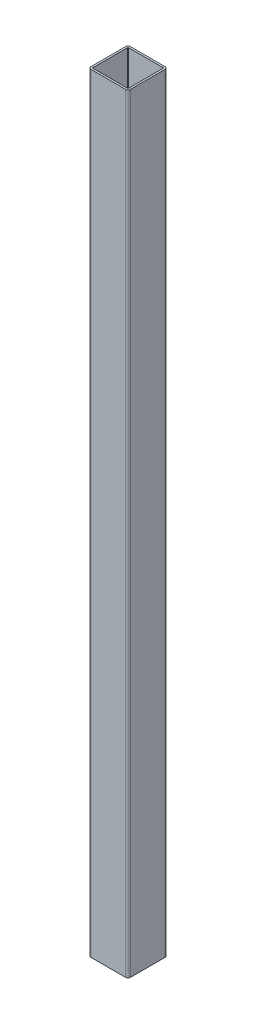
ISO-10303-21;
HEADER;
FILE_DESCRIPTION(('STEP AP214'),'2;1');
FILE_NAME('part.step','',(''),(''),'','','');
FILE_SCHEMA(('AUTOMOTIVE_DESIGN { 1 0 10303 214 1 1 1 1 }'));
ENDSEC;
DATA;
#1=APPLICATION_CONTEXT('core data for automotive mechanical design processes');
#2=APPLICATION_PROTOCOL_DEFINITION('international standard','automotive_design',2000,#1);
#3=PRODUCT_CONTEXT('',#1,'mechanical');
#4=PRODUCT('Part','Part','',(#3));
#5=PRODUCT_RELATED_PRODUCT_CATEGORY('part','',(#4));
#6=PRODUCT_DEFINITION_FORMATION('','',#4);
#7=PRODUCT_DEFINITION_CONTEXT('part definition',#1,'design');
#8=PRODUCT_DEFINITION('design','',#6,#7);
#9=PRODUCT_DEFINITION_SHAPE('','',#8);
#10=(LENGTH_UNIT() NAMED_UNIT(*) SI_UNIT(.MILLI.,.METRE.));
#11=(NAMED_UNIT(*) PLANE_ANGLE_UNIT() SI_UNIT($,.RADIAN.));
#12=(NAMED_UNIT(*) SI_UNIT($,.STERADIAN.) SOLID_ANGLE_UNIT());
#13=UNCERTAINTY_MEASURE_WITH_UNIT(LENGTH_MEASURE(1.E-05),#10,'distance_accuracy_value','');
#14=(GEOMETRIC_REPRESENTATION_CONTEXT(3) GLOBAL_UNCERTAINTY_ASSIGNED_CONTEXT((#13)) GLOBAL_UNIT_ASSIGNED_CONTEXT((#10,
#11,#12)) REPRESENTATION_CONTEXT('',''));
#15=CARTESIAN_POINT('',(0.,0.,0.));
#16=DIRECTION('',(0.,0.,1.));
#17=DIRECTION('',(1.,0.,0.));
#18=AXIS2_PLACEMENT_3D('',#15,#16,#17);
#19=CARTESIAN_POINT('',(126.666666666667,2762.5,-126.666666666667));
#20=DIRECTION('',(0.,-1.,0.));
#21=DIRECTION('',(0.,0.,-1.));
#22=AXIS2_PLACEMENT_3D('',#19,#20,#21);
#23=PLANE('',#22);
#24=CARTESIAN_POINT('',(126.666666666667,2762.5,-126.666666666667));
#25=DIRECTION('',(0.,1.,0.));
#26=DIRECTION('',(0.,0.,-1.));
#27=AXIS2_PLACEMENT_3D('',#24,#25,#26);
#28=CIRCLE('',#27,15.);
#29=CARTESIAN_POINT('',(141.666666666667,2762.5,-126.666666666667));
#30=VERTEX_POINT('',#29);
#31=CARTESIAN_POINT('',(126.666666666667,2762.5,-141.666666666667));
#32=VERTEX_POINT('',#31);
#33=EDGE_CURVE('E217',#30,#32,#28,.T.);
#34=ORIENTED_EDGE('',*,*,#33,.T.);
#35=DIRECTION('',(-1.,0.,0.));
#36=VECTOR('',#35,1.);
#37=CARTESIAN_POINT('',(-93.3333333333332,2762.5,-141.666666666667));
#38=LINE('',#37,#36);
#39=CARTESIAN_POINT('',(-93.3333333333332,2762.5,-141.666666666667));
#40=VERTEX_POINT('',#39);
#41=EDGE_CURVE('E220',#32,#40,#38,.T.);
#42=ORIENTED_EDGE('',*,*,#41,.T.);
#43=CARTESIAN_POINT('',(-93.3333333333332,2762.5,-126.666666666667));
#44=DIRECTION('',(0.,1.,0.));
#45=DIRECTION('',(0.,0.,-1.));
#46=AXIS2_PLACEMENT_3D('',#43,#44,#45);
#47=CIRCLE('',#46,15.);
#48=CARTESIAN_POINT('',(-108.333333333333,2762.5,-126.666666666667));
#49=VERTEX_POINT('',#48);
#50=EDGE_CURVE('E223',#40,#49,#47,.T.);
#51=ORIENTED_EDGE('',*,*,#50,.T.);
#52=DIRECTION('',(0.,0.,1.));
#53=VECTOR('',#52,1.);
#54=CARTESIAN_POINT('',(-108.333333333333,2762.5,93.3333333333332));
#55=LINE('',#54,#53);
#56=CARTESIAN_POINT('',(-108.333333333333,2762.5,93.3333333333332));
#57=VERTEX_POINT('',#56);
#58=EDGE_CURVE('E225',#49,#57,#55,.T.);
#59=ORIENTED_EDGE('',*,*,#58,.T.);
#60=CARTESIAN_POINT('',(-93.3333333333332,2762.5,93.3333333333333));
#61=DIRECTION('',(0.,1.,0.));
#62=DIRECTION('',(0.,0.,-1.));
#63=AXIS2_PLACEMENT_3D('',#60,#61,#62);
#64=CIRCLE('',#63,15.);
#65=CARTESIAN_POINT('',(-93.3333333333331,2762.5,108.333333333333));
#66=VERTEX_POINT('',#65);
#67=EDGE_CURVE('E227',#57,#66,#64,.T.);
#68=ORIENTED_EDGE('',*,*,#67,.T.);
#69=DIRECTION('',(1.,0.,0.));
#70=VECTOR('',#69,1.);
#71=CARTESIAN_POINT('',(-93.3333333333331,2762.5,108.333333333333));
#72=LINE('',#71,#70);
#73=CARTESIAN_POINT('',(126.666666666667,2762.5,108.333333333333));
#74=VERTEX_POINT('',#73);
#75=EDGE_CURVE('E229',#66,#74,#72,.T.);
#76=ORIENTED_EDGE('',*,*,#75,.T.);
#77=CARTESIAN_POINT('',(126.666666666667,2762.5,93.3333333333333));
#78=DIRECTION('',(0.,1.,0.));
#79=DIRECTION('',(0.,0.,1.));
#80=AXIS2_PLACEMENT_3D('',#77,#78,#79);
#81=CIRCLE('',#80,15.);
#82=CARTESIAN_POINT('',(141.666666666667,2762.5,93.3333333333333));
#83=VERTEX_POINT('',#82);
#84=EDGE_CURVE('E231',#74,#83,#81,.T.);
#85=ORIENTED_EDGE('',*,*,#84,.T.);
#86=DIRECTION('',(0.,0.,-1.));
#87=VECTOR('',#86,1.);
#88=CARTESIAN_POINT('',(141.666666666667,2762.5,93.3333333333333));
#89=LINE('',#88,#87);
#90=EDGE_CURVE('E233',#83,#30,#89,.T.);
#91=ORIENTED_EDGE('',*,*,#90,.T.);
#92=EDGE_LOOP('',(#34,#42,#51,#59,#68,#76,#85,#91));
#93=FACE_BOUND('',#92,.T.);
#94=CARTESIAN_POINT('',(-93.3333333333332,2762.5,93.3333333333333));
#95=DIRECTION('',(0.,1.,0.));
#96=DIRECTION('',(0.,0.,-1.));
#97=AXIS2_PLACEMENT_3D('',#94,#95,#96);
#98=CIRCLE('',#97,3.);
#99=CARTESIAN_POINT('',(-96.3333333333332,2762.5,93.3333333333332));
#100=VERTEX_POINT('',#99);
#101=CARTESIAN_POINT('',(-93.3333333333331,2762.5,96.3333333333333));
#102=VERTEX_POINT('',#101);
#103=EDGE_CURVE('E152',#100,#102,#98,.T.);
#104=ORIENTED_EDGE('',*,*,#103,.F.);
#105=DIRECTION('',(0.,0.,1.));
#106=VECTOR('',#105,1.);
#107=CARTESIAN_POINT('',(-96.3333333333332,2762.5,93.3333333333332));
#108=LINE('',#107,#106);
#109=CARTESIAN_POINT('',(-96.3333333333332,2762.5,-126.666666666667));
#110=VERTEX_POINT('',#109);
#111=EDGE_CURVE('E185',#110,#100,#108,.T.);
#112=ORIENTED_EDGE('',*,*,#111,.F.);
#113=CARTESIAN_POINT('',(-93.3333333333332,2762.5,-126.666666666667));
#114=DIRECTION('',(0.,1.,0.));
#115=DIRECTION('',(0.,0.,-1.));
#116=AXIS2_PLACEMENT_3D('',#113,#114,#115);
#117=CIRCLE('',#116,2.99999999999999);
#118=CARTESIAN_POINT('',(-93.3333333333332,2762.5,-129.666666666667));
#119=VERTEX_POINT('',#118);
#120=EDGE_CURVE('E183',#119,#110,#117,.T.);
#121=ORIENTED_EDGE('',*,*,#120,.F.);
#122=DIRECTION('',(-1.,0.,0.));
#123=VECTOR('',#122,1.);
#124=CARTESIAN_POINT('',(-93.3333333333332,2762.5,-129.666666666667));
#125=LINE('',#124,#123);
#126=CARTESIAN_POINT('',(126.666666666667,2762.5,-129.666666666667));
#127=VERTEX_POINT('',#126);
#128=EDGE_CURVE('E181',#127,#119,#125,.T.);
#129=ORIENTED_EDGE('',*,*,#128,.F.);
#130=CARTESIAN_POINT('',(126.666666666667,2762.5,-126.666666666667));
#131=DIRECTION('',(0.,1.,0.));
#132=DIRECTION('',(0.,0.,-1.));
#133=AXIS2_PLACEMENT_3D('',#130,#131,#132);
#134=CIRCLE('',#133,3.00000000000003);
#135=CARTESIAN_POINT('',(129.666666666667,2762.5,-126.666666666667));
#136=VERTEX_POINT('',#135);
#137=EDGE_CURVE('E179',#136,#127,#134,.T.);
#138=ORIENTED_EDGE('',*,*,#137,.F.);
#139=DIRECTION('',(0.,0.,-1.));
#140=VECTOR('',#139,1.);
#141=CARTESIAN_POINT('',(129.666666666667,2762.5,93.3333333333333));
#142=LINE('',#141,#140);
#143=CARTESIAN_POINT('',(129.666666666667,2762.5,93.3333333333333));
#144=VERTEX_POINT('',#143);
#145=EDGE_CURVE('E175',#144,#136,#142,.T.);
#146=ORIENTED_EDGE('',*,*,#145,.F.);
#147=CARTESIAN_POINT('',(126.666666666667,2762.5,93.3333333333333));
#148=DIRECTION('',(0.,1.,0.));
#149=DIRECTION('',(0.,0.,1.));
#150=AXIS2_PLACEMENT_3D('',#147,#148,#149);
#151=CIRCLE('',#150,3.00000000000002);
#152=CARTESIAN_POINT('',(126.666666666667,2762.5,96.3333333333334));
#153=VERTEX_POINT('',#152);
#154=EDGE_CURVE('E173',#153,#144,#151,.T.);
#155=ORIENTED_EDGE('',*,*,#154,.F.);
#156=DIRECTION('',(1.,0.,0.));
#157=VECTOR('',#156,1.);
#158=CARTESIAN_POINT('',(-93.3333333333331,2762.5,96.3333333333333));
#159=LINE('',#158,#157);
#160=EDGE_CURVE('E160',#102,#153,#159,.T.);
#161=ORIENTED_EDGE('',*,*,#160,.F.);
#162=EDGE_LOOP('',(#104,#112,#121,#129,#138,#146,#155,#161));
#163=FACE_BOUND('',#162,.T.);
#164=ADVANCED_FACE('F39',(#93,#163),#23,.F.);
#165=CARTESIAN_POINT('',(126.666666666667,-2112.5,-126.666666666667));
#166=DIRECTION('',(0.,-1.,0.));
#167=DIRECTION('',(0.,0.,-1.));
#168=AXIS2_PLACEMENT_3D('',#165,#166,#167);
#169=PLANE('',#168);
#170=CARTESIAN_POINT('',(126.666666666667,-2112.5,-126.666666666667));
#171=DIRECTION('',(0.,1.,0.));
#172=DIRECTION('',(0.,0.,-1.));
#173=AXIS2_PLACEMENT_3D('',#170,#171,#172);
#174=CIRCLE('',#173,15.);
#175=CARTESIAN_POINT('',(141.666666666667,-2112.5,-126.666666666667));
#176=VERTEX_POINT('',#175);
#177=CARTESIAN_POINT('',(126.666666666667,-2112.5,-141.666666666667));
#178=VERTEX_POINT('',#177);
#179=EDGE_CURVE('E168',#176,#178,#174,.T.);
#180=ORIENTED_EDGE('',*,*,#179,.F.);
#181=DIRECTION('',(0.,0.,-1.));
#182=VECTOR('',#181,1.);
#183=CARTESIAN_POINT('',(141.666666666667,-2112.5,93.3333333333333));
#184=LINE('',#183,#182);
#185=CARTESIAN_POINT('',(141.666666666667,-2112.5,93.3333333333333));
#186=VERTEX_POINT('',#185);
#187=EDGE_CURVE('E221',#186,#176,#184,.T.);
#188=ORIENTED_EDGE('',*,*,#187,.F.);
#189=CARTESIAN_POINT('',(126.666666666667,-2112.5,93.3333333333333));
#190=DIRECTION('',(0.,1.,0.));
#191=DIRECTION('',(0.,0.,1.));
#192=AXIS2_PLACEMENT_3D('',#189,#190,#191);
#193=CIRCLE('',#192,15.);
#194=CARTESIAN_POINT('',(126.666666666667,-2112.5,108.333333333333));
#195=VERTEX_POINT('',#194);
#196=EDGE_CURVE('E248',#195,#186,#193,.T.);
#197=ORIENTED_EDGE('',*,*,#196,.F.);
#198=DIRECTION('',(1.,0.,0.));
#199=VECTOR('',#198,1.);
#200=CARTESIAN_POINT('',(-93.3333333333331,-2112.5,108.333333333333));
#201=LINE('',#200,#199);
#202=CARTESIAN_POINT('',(-93.3333333333331,-2112.5,108.333333333333));
#203=VERTEX_POINT('',#202);
#204=EDGE_CURVE('E246',#203,#195,#201,.T.);
#205=ORIENTED_EDGE('',*,*,#204,.F.);
#206=CARTESIAN_POINT('',(-93.3333333333332,-2112.5,93.3333333333333));
#207=DIRECTION('',(0.,1.,0.));
#208=DIRECTION('',(0.,0.,-1.));
#209=AXIS2_PLACEMENT_3D('',#206,#207,#208);
#210=CIRCLE('',#209,15.);
#211=CARTESIAN_POINT('',(-108.333333333333,-2112.5,93.3333333333332));
#212=VERTEX_POINT('',#211);
#213=EDGE_CURVE('E244',#212,#203,#210,.T.);
#214=ORIENTED_EDGE('',*,*,#213,.F.);
#215=DIRECTION('',(0.,0.,1.));
#216=VECTOR('',#215,1.);
#217=CARTESIAN_POINT('',(-108.333333333333,-2112.5,93.3333333333332));
#218=LINE('',#217,#216);
#219=CARTESIAN_POINT('',(-108.333333333333,-2112.5,-126.666666666667));
#220=VERTEX_POINT('',#219);
#221=EDGE_CURVE('E242',#220,#212,#218,.T.);
#222=ORIENTED_EDGE('',*,*,#221,.F.);
#223=CARTESIAN_POINT('',(-93.3333333333332,-2112.5,-126.666666666667));
#224=DIRECTION('',(0.,1.,0.));
#225=DIRECTION('',(0.,0.,-1.));
#226=AXIS2_PLACEMENT_3D('',#223,#224,#225);
#227=CIRCLE('',#226,15.);
#228=CARTESIAN_POINT('',(-93.3333333333332,-2112.5,-141.666666666667));
#229=VERTEX_POINT('',#228);
#230=EDGE_CURVE('E240',#229,#220,#227,.T.);
#231=ORIENTED_EDGE('',*,*,#230,.F.);
#232=DIRECTION('',(-1.,0.,0.));
#233=VECTOR('',#232,1.);
#234=CARTESIAN_POINT('',(-93.3333333333332,-2112.5,-141.666666666667));
#235=LINE('',#234,#233);
#236=EDGE_CURVE('E238',#178,#229,#235,.T.);
#237=ORIENTED_EDGE('',*,*,#236,.F.);
#238=EDGE_LOOP('',(#180,#188,#197,#205,#214,#222,#231,#237));
#239=FACE_BOUND('',#238,.T.);
#240=DIRECTION('',(0.,0.,1.));
#241=VECTOR('',#240,1.);
#242=CARTESIAN_POINT('',(-96.3333333333332,-2112.5,93.3333333333332));
#243=LINE('',#242,#241);
#244=CARTESIAN_POINT('',(-96.3333333333332,-2112.5,-126.666666666667));
#245=VERTEX_POINT('',#244);
#246=CARTESIAN_POINT('',(-96.3333333333332,-2112.5,93.3333333333332));
#247=VERTEX_POINT('',#246);
#248=EDGE_CURVE('E161',#245,#247,#243,.T.);
#249=ORIENTED_EDGE('',*,*,#248,.T.);
#250=CARTESIAN_POINT('',(-93.3333333333332,-2112.5,93.3333333333333));
#251=DIRECTION('',(0.,1.,0.));
#252=DIRECTION('',(0.,0.,-1.));
#253=AXIS2_PLACEMENT_3D('',#250,#251,#252);
#254=CIRCLE('',#253,3.);
#255=CARTESIAN_POINT('',(-93.3333333333331,-2112.5,96.3333333333333));
#256=VERTEX_POINT('',#255);
#257=EDGE_CURVE('E62',#247,#256,#254,.T.);
#258=ORIENTED_EDGE('',*,*,#257,.T.);
#259=DIRECTION('',(1.,0.,0.));
#260=VECTOR('',#259,1.);
#261=CARTESIAN_POINT('',(-93.3333333333331,-2112.5,96.3333333333333));
#262=LINE('',#261,#260);
#263=CARTESIAN_POINT('',(126.666666666667,-2112.5,96.3333333333334));
#264=VERTEX_POINT('',#263);
#265=EDGE_CURVE('E167',#256,#264,#262,.T.);
#266=ORIENTED_EDGE('',*,*,#265,.T.);
#267=CARTESIAN_POINT('',(126.666666666667,-2112.5,93.3333333333333));
#268=DIRECTION('',(0.,1.,0.));
#269=DIRECTION('',(0.,0.,1.));
#270=AXIS2_PLACEMENT_3D('',#267,#268,#269);
#271=CIRCLE('',#270,3.00000000000002);
#272=CARTESIAN_POINT('',(129.666666666667,-2112.5,93.3333333333333));
#273=VERTEX_POINT('',#272);
#274=EDGE_CURVE('E189',#264,#273,#271,.T.);
#275=ORIENTED_EDGE('',*,*,#274,.T.);
#276=DIRECTION('',(0.,0.,-1.));
#277=VECTOR('',#276,1.);
#278=CARTESIAN_POINT('',(129.666666666667,-2112.5,93.3333333333333));
#279=LINE('',#278,#277);
#280=CARTESIAN_POINT('',(129.666666666667,-2112.5,-126.666666666667));
#281=VERTEX_POINT('',#280);
#282=EDGE_CURVE('E192',#273,#281,#279,.T.);
#283=ORIENTED_EDGE('',*,*,#282,.T.);
#284=CARTESIAN_POINT('',(126.666666666667,-2112.5,-126.666666666667));
#285=DIRECTION('',(0.,1.,0.));
#286=DIRECTION('',(0.,0.,-1.));
#287=AXIS2_PLACEMENT_3D('',#284,#285,#286);
#288=CIRCLE('',#287,3.00000000000003);
#289=CARTESIAN_POINT('',(126.666666666667,-2112.5,-129.666666666667));
#290=VERTEX_POINT('',#289);
#291=EDGE_CURVE('E195',#281,#290,#288,.T.);
#292=ORIENTED_EDGE('',*,*,#291,.T.);
#293=DIRECTION('',(-1.,0.,0.));
#294=VECTOR('',#293,1.);
#295=CARTESIAN_POINT('',(-93.3333333333332,-2112.5,-129.666666666667));
#296=LINE('',#295,#294);
#297=CARTESIAN_POINT('',(-93.3333333333332,-2112.5,-129.666666666667));
#298=VERTEX_POINT('',#297);
#299=EDGE_CURVE('E198',#290,#298,#296,.T.);
#300=ORIENTED_EDGE('',*,*,#299,.T.);
#301=CARTESIAN_POINT('',(-93.3333333333332,-2112.5,-126.666666666667));
#302=DIRECTION('',(0.,1.,0.));
#303=DIRECTION('',(0.,0.,-1.));
#304=AXIS2_PLACEMENT_3D('',#301,#302,#303);
#305=CIRCLE('',#304,2.99999999999999);
#306=EDGE_CURVE('E201',#298,#245,#305,.T.);
#307=ORIENTED_EDGE('',*,*,#306,.T.);
#308=EDGE_LOOP('',(#249,#258,#266,#275,#283,#292,#300,#307));
#309=FACE_BOUND('',#308,.T.);
#310=ADVANCED_FACE('F278',(#239,#309),#169,.T.);
#311=CARTESIAN_POINT('',(126.666666666667,2762.5,-126.666666666667));
#312=DIRECTION('',(0.,-1.,0.));
#313=DIRECTION('',(0.,0.,-1.));
#314=AXIS2_PLACEMENT_3D('',#311,#312,#313);
#315=CYLINDRICAL_SURFACE('',#314,15.);
#316=ORIENTED_EDGE('',*,*,#179,.T.);
#317=DIRECTION('',(0.,-1.,0.));
#318=VECTOR('',#317,1.);
#319=CARTESIAN_POINT('',(126.666666666667,2762.5,-141.666666666667));
#320=LINE('',#319,#318);
#321=EDGE_CURVE('E11',#32,#178,#320,.T.);
#322=ORIENTED_EDGE('',*,*,#321,.F.);
#323=ORIENTED_EDGE('',*,*,#33,.F.);
#324=DIRECTION('',(0.,-1.,0.));
#325=VECTOR('',#324,1.);
#326=CARTESIAN_POINT('',(141.666666666667,2762.5,-126.666666666667));
#327=LINE('',#326,#325);
#328=EDGE_CURVE('E235',#30,#176,#327,.T.);
#329=ORIENTED_EDGE('',*,*,#328,.T.);
#330=EDGE_LOOP('',(#316,#322,#323,#329));
#331=FACE_BOUND('',#330,.T.);
#332=ADVANCED_FACE('F41',(#331),#315,.T.);
#333=CARTESIAN_POINT('',(-93.3333333333332,2762.5,-141.666666666667));
#334=DIRECTION('',(0.,0.,1.));
#335=DIRECTION('',(1.,0.,0.));
#336=AXIS2_PLACEMENT_3D('',#333,#334,#335);
#337=PLANE('',#336);
#338=ORIENTED_EDGE('',*,*,#236,.T.);
#339=DIRECTION('',(0.,-1.,0.));
#340=VECTOR('',#339,1.);
#341=CARTESIAN_POINT('',(-93.3333333333332,2762.5,-141.666666666667));
#342=LINE('',#341,#340);
#343=EDGE_CURVE('E47',#40,#229,#342,.T.);
#344=ORIENTED_EDGE('',*,*,#343,.F.);
#345=ORIENTED_EDGE('',*,*,#41,.F.);
#346=ORIENTED_EDGE('',*,*,#321,.T.);
#347=EDGE_LOOP('',(#338,#344,#345,#346));
#348=FACE_BOUND('',#347,.T.);
#349=ADVANCED_FACE('F295',(#348),#337,.F.);
#350=CARTESIAN_POINT('',(-93.3333333333332,2762.5,-126.666666666667));
#351=DIRECTION('',(0.,-1.,0.));
#352=DIRECTION('',(0.,0.,-1.));
#353=AXIS2_PLACEMENT_3D('',#350,#351,#352);
#354=CYLINDRICAL_SURFACE('',#353,15.);
#355=ORIENTED_EDGE('',*,*,#230,.T.);
#356=DIRECTION('',(0.,-1.,0.));
#357=VECTOR('',#356,1.);
#358=CARTESIAN_POINT('',(-108.333333333333,2762.5,-126.666666666667));
#359=LINE('',#358,#357);
#360=EDGE_CURVE('E265',#49,#220,#359,.T.);
#361=ORIENTED_EDGE('',*,*,#360,.F.);
#362=ORIENTED_EDGE('',*,*,#50,.F.);
#363=ORIENTED_EDGE('',*,*,#343,.T.);
#364=EDGE_LOOP('',(#355,#361,#362,#363));
#365=FACE_BOUND('',#364,.T.);
#366=ADVANCED_FACE('F272',(#365),#354,.T.);
#367=CARTESIAN_POINT('',(-108.333333333333,2762.5,93.3333333333332));
#368=DIRECTION('',(1.,0.,0.));
#369=DIRECTION('',(0.,0.,-1.));
#370=AXIS2_PLACEMENT_3D('',#367,#368,#369);
#371=PLANE('',#370);
#372=ORIENTED_EDGE('',*,*,#221,.T.);
#373=DIRECTION('',(0.,-1.,0.));
#374=VECTOR('',#373,1.);
#375=CARTESIAN_POINT('',(-108.333333333333,2762.5,93.3333333333332));
#376=LINE('',#375,#374);
#377=EDGE_CURVE('E262',#57,#212,#376,.T.);
#378=ORIENTED_EDGE('',*,*,#377,.F.);
#379=ORIENTED_EDGE('',*,*,#58,.F.);
#380=ORIENTED_EDGE('',*,*,#360,.T.);
#381=EDGE_LOOP('',(#372,#378,#379,#380));
#382=FACE_BOUND('',#381,.T.);
#383=ADVANCED_FACE('F284',(#382),#371,.F.);
#384=CARTESIAN_POINT('',(-93.3333333333332,2762.5,93.3333333333333));
#385=DIRECTION('',(0.,-1.,0.));
#386=DIRECTION('',(0.,0.,-1.));
#387=AXIS2_PLACEMENT_3D('',#384,#385,#386);
#388=CYLINDRICAL_SURFACE('',#387,15.);
#389=ORIENTED_EDGE('',*,*,#213,.T.);
#390=DIRECTION('',(0.,-1.,0.));
#391=VECTOR('',#390,1.);
#392=CARTESIAN_POINT('',(-93.3333333333331,2762.5,108.333333333333));
#393=LINE('',#392,#391);
#394=EDGE_CURVE('E259',#66,#203,#393,.T.);
#395=ORIENTED_EDGE('',*,*,#394,.F.);
#396=ORIENTED_EDGE('',*,*,#67,.F.);
#397=ORIENTED_EDGE('',*,*,#377,.T.);
#398=EDGE_LOOP('',(#389,#395,#396,#397));
#399=FACE_BOUND('',#398,.T.);
#400=ADVANCED_FACE('F288',(#399),#388,.T.);
#401=CARTESIAN_POINT('',(-93.3333333333331,2762.5,108.333333333333));
#402=DIRECTION('',(0.,0.,-1.));
#403=DIRECTION('',(-1.,0.,0.));
#404=AXIS2_PLACEMENT_3D('',#401,#402,#403);
#405=PLANE('',#404);
#406=ORIENTED_EDGE('',*,*,#204,.T.);
#407=DIRECTION('',(0.,-1.,0.));
#408=VECTOR('',#407,1.);
#409=CARTESIAN_POINT('',(126.666666666667,2762.5,108.333333333333));
#410=LINE('',#409,#408);
#411=EDGE_CURVE('E256',#74,#195,#410,.T.);
#412=ORIENTED_EDGE('',*,*,#411,.F.);
#413=ORIENTED_EDGE('',*,*,#75,.F.);
#414=ORIENTED_EDGE('',*,*,#394,.T.);
#415=EDGE_LOOP('',(#406,#412,#413,#414));
#416=FACE_BOUND('',#415,.T.);
#417=ADVANCED_FACE('F308',(#416),#405,.F.);
#418=CARTESIAN_POINT('',(126.666666666667,2762.5,93.3333333333333));
#419=DIRECTION('',(0.,-1.,0.));
#420=DIRECTION('',(0.,0.,-1.));
#421=AXIS2_PLACEMENT_3D('',#418,#419,#420);
#422=CYLINDRICAL_SURFACE('',#421,15.);
#423=ORIENTED_EDGE('',*,*,#196,.T.);
#424=DIRECTION('',(0.,-1.,0.));
#425=VECTOR('',#424,1.);
#426=CARTESIAN_POINT('',(141.666666666667,2762.5,93.3333333333333));
#427=LINE('',#426,#425);
#428=EDGE_CURVE('E253',#83,#186,#427,.T.);
#429=ORIENTED_EDGE('',*,*,#428,.F.);
#430=ORIENTED_EDGE('',*,*,#84,.F.);
#431=ORIENTED_EDGE('',*,*,#411,.T.);
#432=EDGE_LOOP('',(#423,#429,#430,#431));
#433=FACE_BOUND('',#432,.T.);
#434=ADVANCED_FACE('F306',(#433),#422,.T.);
#435=CARTESIAN_POINT('',(141.666666666667,2762.5,93.3333333333333));
#436=DIRECTION('',(-1.,0.,0.));
#437=DIRECTION('',(0.,0.,1.));
#438=AXIS2_PLACEMENT_3D('',#435,#436,#437);
#439=PLANE('',#438);
#440=ORIENTED_EDGE('',*,*,#187,.T.);
#441=ORIENTED_EDGE('',*,*,#328,.F.);
#442=ORIENTED_EDGE('',*,*,#90,.F.);
#443=ORIENTED_EDGE('',*,*,#428,.T.);
#444=EDGE_LOOP('',(#440,#441,#442,#443));
#445=FACE_BOUND('',#444,.T.);
#446=ADVANCED_FACE('F301',(#445),#439,.F.);
#447=CARTESIAN_POINT('',(-93.3333333333332,2762.5,93.3333333333333));
#448=DIRECTION('',(0.,-1.,0.));
#449=DIRECTION('',(0.,0.,-1.));
#450=AXIS2_PLACEMENT_3D('',#447,#448,#449);
#451=CYLINDRICAL_SURFACE('',#450,3.);
#452=ORIENTED_EDGE('',*,*,#257,.F.);
#453=DIRECTION('',(0.,-1.,0.));
#454=VECTOR('',#453,1.);
#455=CARTESIAN_POINT('',(-96.3333333333332,2762.5,93.3333333333332));
#456=LINE('',#455,#454);
#457=EDGE_CURVE('E156',#100,#247,#456,.T.);
#458=ORIENTED_EDGE('',*,*,#457,.F.);
#459=ORIENTED_EDGE('',*,*,#103,.T.);
#460=DIRECTION('',(0.,-1.,0.));
#461=VECTOR('',#460,1.);
#462=CARTESIAN_POINT('',(-93.3333333333331,2762.5,96.3333333333333));
#463=LINE('',#462,#461);
#464=EDGE_CURVE('E155',#102,#256,#463,.T.);
#465=ORIENTED_EDGE('',*,*,#464,.T.);
#466=EDGE_LOOP('',(#452,#458,#459,#465));
#467=FACE_BOUND('',#466,.T.);
#468=ADVANCED_FACE('F154',(#467),#451,.F.);
#469=CARTESIAN_POINT('',(-93.3333333333331,2762.5,96.3333333333333));
#470=DIRECTION('',(0.,0.,-1.));
#471=DIRECTION('',(-1.,0.,0.));
#472=AXIS2_PLACEMENT_3D('',#469,#470,#471);
#473=PLANE('',#472);
#474=ORIENTED_EDGE('',*,*,#265,.F.);
#475=ORIENTED_EDGE('',*,*,#464,.F.);
#476=ORIENTED_EDGE('',*,*,#160,.T.);
#477=DIRECTION('',(0.,-1.,0.));
#478=VECTOR('',#477,1.);
#479=CARTESIAN_POINT('',(126.666666666667,2762.5,96.3333333333334));
#480=LINE('',#479,#478);
#481=EDGE_CURVE('E169',#153,#264,#480,.T.);
#482=ORIENTED_EDGE('',*,*,#481,.T.);
#483=EDGE_LOOP('',(#474,#475,#476,#482));
#484=FACE_BOUND('',#483,.T.);
#485=ADVANCED_FACE('F164',(#484),#473,.T.);
#486=CARTESIAN_POINT('',(126.666666666667,2762.5,93.3333333333333));
#487=DIRECTION('',(0.,-1.,0.));
#488=DIRECTION('',(0.,0.,-1.));
#489=AXIS2_PLACEMENT_3D('',#486,#487,#488);
#490=CYLINDRICAL_SURFACE('',#489,3.00000000000002);
#491=ORIENTED_EDGE('',*,*,#274,.F.);
#492=ORIENTED_EDGE('',*,*,#481,.F.);
#493=ORIENTED_EDGE('',*,*,#154,.T.);
#494=DIRECTION('',(0.,-1.,0.));
#495=VECTOR('',#494,1.);
#496=CARTESIAN_POINT('',(129.666666666667,2762.5,93.3333333333333));
#497=LINE('',#496,#495);
#498=EDGE_CURVE('E214',#144,#273,#497,.T.);
#499=ORIENTED_EDGE('',*,*,#498,.T.);
#500=EDGE_LOOP('',(#491,#492,#493,#499));
#501=FACE_BOUND('',#500,.T.);
#502=ADVANCED_FACE('F333',(#501),#490,.F.);
#503=CARTESIAN_POINT('',(129.666666666667,2762.5,93.3333333333333));
#504=DIRECTION('',(-1.,0.,0.));
#505=DIRECTION('',(0.,0.,1.));
#506=AXIS2_PLACEMENT_3D('',#503,#504,#505);
#507=PLANE('',#506);
#508=ORIENTED_EDGE('',*,*,#282,.F.);
#509=ORIENTED_EDGE('',*,*,#498,.F.);
#510=ORIENTED_EDGE('',*,*,#145,.T.);
#511=DIRECTION('',(0.,-1.,0.));
#512=VECTOR('',#511,1.);
#513=CARTESIAN_POINT('',(129.666666666667,2762.5,-126.666666666667));
#514=LINE('',#513,#512);
#515=EDGE_CURVE('E212',#136,#281,#514,.T.);
#516=ORIENTED_EDGE('',*,*,#515,.T.);
#517=EDGE_LOOP('',(#508,#509,#510,#516));
#518=FACE_BOUND('',#517,.T.);
#519=ADVANCED_FACE('F337',(#518),#507,.T.);
#520=CARTESIAN_POINT('',(126.666666666667,2762.5,-126.666666666667));
#521=DIRECTION('',(0.,-1.,0.));
#522=DIRECTION('',(0.,0.,-1.));
#523=AXIS2_PLACEMENT_3D('',#520,#521,#522);
#524=CYLINDRICAL_SURFACE('',#523,3.00000000000003);
#525=ORIENTED_EDGE('',*,*,#291,.F.);
#526=ORIENTED_EDGE('',*,*,#515,.F.);
#527=ORIENTED_EDGE('',*,*,#137,.T.);
#528=DIRECTION('',(0.,-1.,0.));
#529=VECTOR('',#528,1.);
#530=CARTESIAN_POINT('',(126.666666666667,2762.5,-129.666666666667));
#531=LINE('',#530,#529);
#532=EDGE_CURVE('E210',#127,#290,#531,.T.);
#533=ORIENTED_EDGE('',*,*,#532,.T.);
#534=EDGE_LOOP('',(#525,#526,#527,#533));
#535=FACE_BOUND('',#534,.T.);
#536=ADVANCED_FACE('F343',(#535),#524,.F.);
#537=CARTESIAN_POINT('',(-93.3333333333332,2762.5,-129.666666666667));
#538=DIRECTION('',(0.,0.,1.));
#539=DIRECTION('',(1.,0.,0.));
#540=AXIS2_PLACEMENT_3D('',#537,#538,#539);
#541=PLANE('',#540);
#542=ORIENTED_EDGE('',*,*,#299,.F.);
#543=ORIENTED_EDGE('',*,*,#532,.F.);
#544=ORIENTED_EDGE('',*,*,#128,.T.);
#545=DIRECTION('',(0.,-1.,0.));
#546=VECTOR('',#545,1.);
#547=CARTESIAN_POINT('',(-93.3333333333332,2762.5,-129.666666666667));
#548=LINE('',#547,#546);
#549=EDGE_CURVE('E208',#119,#298,#548,.T.);
#550=ORIENTED_EDGE('',*,*,#549,.T.);
#551=EDGE_LOOP('',(#542,#543,#544,#550));
#552=FACE_BOUND('',#551,.T.);
#553=ADVANCED_FACE('F347',(#552),#541,.T.);
#554=CARTESIAN_POINT('',(-93.3333333333332,2762.5,-126.666666666667));
#555=DIRECTION('',(0.,-1.,0.));
#556=DIRECTION('',(0.,0.,-1.));
#557=AXIS2_PLACEMENT_3D('',#554,#555,#556);
#558=CYLINDRICAL_SURFACE('',#557,2.99999999999999);
#559=ORIENTED_EDGE('',*,*,#306,.F.);
#560=ORIENTED_EDGE('',*,*,#549,.F.);
#561=ORIENTED_EDGE('',*,*,#120,.T.);
#562=DIRECTION('',(0.,-1.,0.));
#563=VECTOR('',#562,1.);
#564=CARTESIAN_POINT('',(-96.3333333333332,2762.5,-126.666666666667));
#565=LINE('',#564,#563);
#566=EDGE_CURVE('E54',#110,#245,#565,.T.);
#567=ORIENTED_EDGE('',*,*,#566,.T.);
#568=EDGE_LOOP('',(#559,#560,#561,#567));
#569=FACE_BOUND('',#568,.T.);
#570=ADVANCED_FACE('F351',(#569),#558,.F.);
#571=CARTESIAN_POINT('',(-96.3333333333332,2762.5,93.3333333333332));
#572=DIRECTION('',(1.,0.,0.));
#573=DIRECTION('',(0.,0.,-1.));
#574=AXIS2_PLACEMENT_3D('',#571,#572,#573);
#575=PLANE('',#574);
#576=ORIENTED_EDGE('',*,*,#248,.F.);
#577=ORIENTED_EDGE('',*,*,#566,.F.);
#578=ORIENTED_EDGE('',*,*,#111,.T.);
#579=ORIENTED_EDGE('',*,*,#457,.T.);
#580=EDGE_LOOP('',(#576,#577,#578,#579));
#581=FACE_BOUND('',#580,.T.);
#582=ADVANCED_FACE('F355',(#581),#575,.T.);
#583=CLOSED_SHELL('',(#164,#310,#332,#349,#366,#383,#400,#417,#434,#446,#468,#485,#502,#519,
#536,#553,#570,#582));
#584=MANIFOLD_SOLID_BREP('B2',#583);
#585=ADVANCED_BREP_SHAPE_REPRESENTATION('',(#18,#584),#14);
#586=SHAPE_DEFINITION_REPRESENTATION(#9,#585);
ENDSEC;
END-ISO-10303-21;
